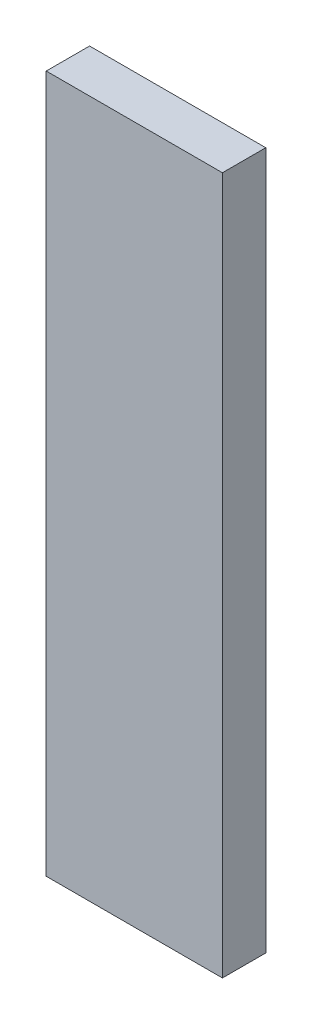
ISO-10303-21;
HEADER;
FILE_DESCRIPTION(('STEP AP214'),'2;1');
FILE_NAME('part.step','',(''),(''),'','','');
FILE_SCHEMA(('AUTOMOTIVE_DESIGN { 1 0 10303 214 1 1 1 1 }'));
ENDSEC;
DATA;
#1=APPLICATION_CONTEXT('core data for automotive mechanical design processes');
#2=APPLICATION_PROTOCOL_DEFINITION('international standard','automotive_design',2000,#1);
#3=PRODUCT_CONTEXT('',#1,'mechanical');
#4=PRODUCT('Part','Part','',(#3));
#5=PRODUCT_RELATED_PRODUCT_CATEGORY('part','',(#4));
#6=PRODUCT_DEFINITION_FORMATION('','',#4);
#7=PRODUCT_DEFINITION_CONTEXT('part definition',#1,'design');
#8=PRODUCT_DEFINITION('design','',#6,#7);
#9=PRODUCT_DEFINITION_SHAPE('','',#8);
#10=(LENGTH_UNIT() NAMED_UNIT(*) SI_UNIT(.MILLI.,.METRE.));
#11=(NAMED_UNIT(*) PLANE_ANGLE_UNIT() SI_UNIT($,.RADIAN.));
#12=(NAMED_UNIT(*) SI_UNIT($,.STERADIAN.) SOLID_ANGLE_UNIT());
#13=UNCERTAINTY_MEASURE_WITH_UNIT(LENGTH_MEASURE(1.E-05),#10,'distance_accuracy_value','');
#14=(GEOMETRIC_REPRESENTATION_CONTEXT(3) GLOBAL_UNCERTAINTY_ASSIGNED_CONTEXT((#13)) GLOBAL_UNIT_ASSIGNED_CONTEXT((#10,
#11,#12)) REPRESENTATION_CONTEXT('',''));
#15=CARTESIAN_POINT('',(0.,0.,0.));
#16=DIRECTION('',(0.,0.,1.));
#17=DIRECTION('',(1.,0.,0.));
#18=AXIS2_PLACEMENT_3D('',#15,#16,#17);
#19=CARTESIAN_POINT('',(-37.5648019739697,-2.3820263364277,1.27));
#20=DIRECTION('',(0.,1.,0.));
#21=DIRECTION('',(0.,0.,1.));
#22=AXIS2_PLACEMENT_3D('',#19,#20,#21);
#23=PLANE('',#22);
#24=DIRECTION('',(1.,0.,0.));
#25=VECTOR('',#24,1.);
#26=CARTESIAN_POINT('',(-37.5648019739697,-2.3820263364277,0.));
#27=LINE('',#26,#25);
#28=CARTESIAN_POINT('',(-37.5648019739697,-2.3820263364277,0.));
#29=VERTEX_POINT('',#28);
#30=CARTESIAN_POINT('',(-32.4024186657096,-2.3820263364277,0.));
#31=VERTEX_POINT('',#30);
#32=EDGE_CURVE('E140',#29,#31,#27,.T.);
#33=ORIENTED_EDGE('',*,*,#32,.T.);
#34=DIRECTION('',(0.,0.,-1.));
#35=VECTOR('',#34,1.);
#36=CARTESIAN_POINT('',(-32.4024186657096,-2.3820263364277,1.27));
#37=LINE('',#36,#35);
#38=CARTESIAN_POINT('',(-32.4024186657096,-2.3820263364277,1.27));
#39=VERTEX_POINT('',#38);
#40=EDGE_CURVE('E11',#39,#31,#37,.T.);
#41=ORIENTED_EDGE('',*,*,#40,.F.);
#42=DIRECTION('',(1.,0.,0.));
#43=VECTOR('',#42,1.);
#44=CARTESIAN_POINT('',(-37.5648019739697,-2.3820263364277,1.27));
#45=LINE('',#44,#43);
#46=CARTESIAN_POINT('',(-37.5648019739697,-2.3820263364277,1.27));
#47=VERTEX_POINT('',#46);
#48=EDGE_CURVE('E81',#47,#39,#45,.T.);
#49=ORIENTED_EDGE('',*,*,#48,.F.);
#50=DIRECTION('',(0.,0.,-1.));
#51=VECTOR('',#50,1.);
#52=CARTESIAN_POINT('',(-37.5648019739697,-2.3820263364277,1.27));
#53=LINE('',#52,#51);
#54=EDGE_CURVE('E152',#47,#29,#53,.T.);
#55=ORIENTED_EDGE('',*,*,#54,.T.);
#56=EDGE_LOOP('',(#33,#41,#49,#55));
#57=FACE_BOUND('',#56,.T.);
#58=ADVANCED_FACE('F33',(#57),#23,.F.);
#59=CARTESIAN_POINT('',(-32.4024186657096,18.0530258479316,1.27));
#60=DIRECTION('',(1.,0.,0.));
#61=DIRECTION('',(0.,0.,-1.));
#62=AXIS2_PLACEMENT_3D('',#59,#60,#61);
#63=PLANE('',#62);
#64=DIRECTION('',(0.,-1.,0.));
#65=VECTOR('',#64,1.);
#66=CARTESIAN_POINT('',(-32.4024186657096,18.0530258479316,0.));
#67=LINE('',#66,#65);
#68=CARTESIAN_POINT('',(-32.4024186657096,18.0530258479316,0.));
#69=VERTEX_POINT('',#68);
#70=EDGE_CURVE('E155',#69,#31,#67,.T.);
#71=ORIENTED_EDGE('',*,*,#70,.F.);
#72=DIRECTION('',(0.,0.,-1.));
#73=VECTOR('',#72,1.);
#74=CARTESIAN_POINT('',(-32.4024186657096,18.0530258479316,1.27));
#75=LINE('',#74,#73);
#76=CARTESIAN_POINT('',(-32.4024186657096,18.0530258479316,1.27));
#77=VERTEX_POINT('',#76);
#78=EDGE_CURVE('E40',#77,#69,#75,.T.);
#79=ORIENTED_EDGE('',*,*,#78,.F.);
#80=DIRECTION('',(0.,-1.,0.));
#81=VECTOR('',#80,1.);
#82=CARTESIAN_POINT('',(-32.4024186657096,18.0530258479316,1.27));
#83=LINE('',#82,#81);
#84=EDGE_CURVE('E145',#77,#39,#83,.T.);
#85=ORIENTED_EDGE('',*,*,#84,.T.);
#86=ORIENTED_EDGE('',*,*,#40,.T.);
#87=EDGE_LOOP('',(#71,#79,#85,#86));
#88=FACE_BOUND('',#87,.T.);
#89=ADVANCED_FACE('F169',(#88),#63,.T.);
#90=CARTESIAN_POINT('',(-37.5648019739697,18.0530258479316,1.27));
#91=DIRECTION('',(0.,1.,0.));
#92=DIRECTION('',(0.,0.,1.));
#93=AXIS2_PLACEMENT_3D('',#90,#91,#92);
#94=PLANE('',#93);
#95=DIRECTION('',(1.,0.,0.));
#96=VECTOR('',#95,1.);
#97=CARTESIAN_POINT('',(-37.5648019739697,18.0530258479316,0.));
#98=LINE('',#97,#96);
#99=CARTESIAN_POINT('',(-37.5648019739697,18.0530258479316,0.));
#100=VERTEX_POINT('',#99);
#101=EDGE_CURVE('E158',#100,#69,#98,.T.);
#102=ORIENTED_EDGE('',*,*,#101,.F.);
#103=DIRECTION('',(0.,0.,-1.));
#104=VECTOR('',#103,1.);
#105=CARTESIAN_POINT('',(-37.5648019739697,18.0530258479316,1.27));
#106=LINE('',#105,#104);
#107=CARTESIAN_POINT('',(-37.5648019739697,18.0530258479316,1.27));
#108=VERTEX_POINT('',#107);
#109=EDGE_CURVE('E163',#108,#100,#106,.T.);
#110=ORIENTED_EDGE('',*,*,#109,.F.);
#111=DIRECTION('',(1.,0.,0.));
#112=VECTOR('',#111,1.);
#113=CARTESIAN_POINT('',(-37.5648019739697,18.0530258479316,1.27));
#114=LINE('',#113,#112);
#115=EDGE_CURVE('E148',#108,#77,#114,.T.);
#116=ORIENTED_EDGE('',*,*,#115,.T.);
#117=ORIENTED_EDGE('',*,*,#78,.T.);
#118=EDGE_LOOP('',(#102,#110,#116,#117));
#119=FACE_BOUND('',#118,.T.);
#120=ADVANCED_FACE('F167',(#119),#94,.T.);
#121=CARTESIAN_POINT('',(-37.5648019739697,18.0530258479316,1.27));
#122=DIRECTION('',(1.,0.,0.));
#123=DIRECTION('',(0.,0.,-1.));
#124=AXIS2_PLACEMENT_3D('',#121,#122,#123);
#125=PLANE('',#124);
#126=DIRECTION('',(0.,0.,-1.));
#127=VECTOR('',#126,1.);
#128=CARTESIAN_POINT('',(-37.5648019739697,16.8739681908789,0.191724219646972));
#129=LINE('',#128,#127);
#130=CARTESIAN_POINT('',(-37.5648019739697,16.8739681908789,1.03065807070379));
#131=VERTEX_POINT('',#130);
#132=CARTESIAN_POINT('',(-37.5648019739697,16.8739681908789,0.191724219646972));
#133=VERTEX_POINT('',#132);
#134=EDGE_CURVE('E134',#131,#133,#129,.T.);
#135=ORIENTED_EDGE('',*,*,#134,.F.);
#136=DIRECTION('',(0.,1.,0.));
#137=VECTOR('',#136,1.);
#138=CARTESIAN_POINT('',(-37.5648019739697,16.8739681908789,1.03065807070379));
#139=LINE('',#138,#137);
#140=CARTESIAN_POINT('',(-37.5648019739697,12.9918277277312,1.03065807070379));
#141=VERTEX_POINT('',#140);
#142=EDGE_CURVE('E47',#141,#131,#139,.T.);
#143=ORIENTED_EDGE('',*,*,#142,.F.);
#144=DIRECTION('',(0.,0.,1.));
#145=VECTOR('',#144,1.);
#146=CARTESIAN_POINT('',(-37.5648019739697,12.9918277277312,0.191724219646972));
#147=LINE('',#146,#145);
#148=CARTESIAN_POINT('',(-37.5648019739697,12.9918277277312,0.191724219646972));
#149=VERTEX_POINT('',#148);
#150=EDGE_CURVE('E125',#149,#141,#147,.T.);
#151=ORIENTED_EDGE('',*,*,#150,.F.);
#152=DIRECTION('',(0.,-1.,0.));
#153=VECTOR('',#152,1.);
#154=CARTESIAN_POINT('',(-37.5648019739697,16.8739681908789,0.191724219646972));
#155=LINE('',#154,#153);
#156=EDGE_CURVE('E128',#133,#149,#155,.T.);
#157=ORIENTED_EDGE('',*,*,#156,.F.);
#158=EDGE_LOOP('',(#135,#143,#151,#157));
#159=FACE_BOUND('',#158,.T.);
#160=DIRECTION('',(0.,-1.,0.));
#161=VECTOR('',#160,1.);
#162=CARTESIAN_POINT('',(-37.5648019739697,18.0530258479316,0.));
#163=LINE('',#162,#161);
#164=EDGE_CURVE('E76',#100,#29,#163,.T.);
#165=ORIENTED_EDGE('',*,*,#164,.T.);
#166=ORIENTED_EDGE('',*,*,#54,.F.);
#167=DIRECTION('',(0.,-1.,0.));
#168=VECTOR('',#167,1.);
#169=CARTESIAN_POINT('',(-37.5648019739697,18.0530258479316,1.27));
#170=LINE('',#169,#168);
#171=EDGE_CURVE('E56',#108,#47,#170,.T.);
#172=ORIENTED_EDGE('',*,*,#171,.F.);
#173=ORIENTED_EDGE('',*,*,#109,.T.);
#174=EDGE_LOOP('',(#165,#166,#172,#173));
#175=FACE_BOUND('',#174,.T.);
#176=ADVANCED_FACE('F174',(#159,#175),#125,.F.);
#177=CARTESIAN_POINT('',(0.,0.,1.27));
#178=DIRECTION('',(0.,0.,-1.));
#179=DIRECTION('',(-1.,0.,0.));
#180=AXIS2_PLACEMENT_3D('',#177,#178,#179);
#181=PLANE('',#180);
#182=ORIENTED_EDGE('',*,*,#48,.T.);
#183=ORIENTED_EDGE('',*,*,#84,.F.);
#184=ORIENTED_EDGE('',*,*,#115,.F.);
#185=ORIENTED_EDGE('',*,*,#171,.T.);
#186=EDGE_LOOP('',(#182,#183,#184,#185));
#187=FACE_BOUND('',#186,.T.);
#188=ADVANCED_FACE('F175',(#187),#181,.F.);
#189=CARTESIAN_POINT('',(0.,0.,0.));
#190=DIRECTION('',(0.,0.,-1.));
#191=DIRECTION('',(-1.,0.,0.));
#192=AXIS2_PLACEMENT_3D('',#189,#190,#191);
#193=PLANE('',#192);
#194=ORIENTED_EDGE('',*,*,#32,.F.);
#195=ORIENTED_EDGE('',*,*,#164,.F.);
#196=ORIENTED_EDGE('',*,*,#101,.T.);
#197=ORIENTED_EDGE('',*,*,#70,.T.);
#198=EDGE_LOOP('',(#194,#195,#196,#197));
#199=FACE_BOUND('',#198,.T.);
#200=ADVANCED_FACE('F172',(#199),#193,.T.);
#201=CARTESIAN_POINT('',(-33.7548019739697,16.8739681908789,1.03065807070379));
#202=DIRECTION('',(0.,0.,1.));
#203=DIRECTION('',(1.,0.,0.));
#204=AXIS2_PLACEMENT_3D('',#201,#202,#203);
#205=PLANE('',#204);
#206=ORIENTED_EDGE('',*,*,#142,.T.);
#207=DIRECTION('',(-1.,0.,0.));
#208=VECTOR('',#207,1.);
#209=CARTESIAN_POINT('',(-33.7548019739697,16.8739681908789,1.03065807070379));
#210=LINE('',#209,#208);
#211=CARTESIAN_POINT('',(-33.7548019739697,16.8739681908789,1.03065807070379));
#212=VERTEX_POINT('',#211);
#213=EDGE_CURVE('E103',#212,#131,#210,.T.);
#214=ORIENTED_EDGE('',*,*,#213,.F.);
#215=DIRECTION('',(0.,1.,0.));
#216=VECTOR('',#215,1.);
#217=CARTESIAN_POINT('',(-33.7548019739697,16.8739681908789,1.03065807070379));
#218=LINE('',#217,#216);
#219=CARTESIAN_POINT('',(-33.7548019739697,12.9918277277312,1.03065807070379));
#220=VERTEX_POINT('',#219);
#221=EDGE_CURVE('E107',#220,#212,#218,.T.);
#222=ORIENTED_EDGE('',*,*,#221,.F.);
#223=DIRECTION('',(-1.,0.,0.));
#224=VECTOR('',#223,1.);
#225=CARTESIAN_POINT('',(-33.7548019739697,12.9918277277312,1.03065807070379));
#226=LINE('',#225,#224);
#227=EDGE_CURVE('E138',#220,#141,#226,.T.);
#228=ORIENTED_EDGE('',*,*,#227,.T.);
#229=EDGE_LOOP('',(#206,#214,#222,#228));
#230=FACE_BOUND('',#229,.T.);
#231=ADVANCED_FACE('F105',(#230),#205,.F.);
#232=CARTESIAN_POINT('',(-33.7548019739697,12.9918277277312,0.191724219646972));
#233=DIRECTION('',(0.,-1.,0.));
#234=DIRECTION('',(0.,0.,-1.));
#235=AXIS2_PLACEMENT_3D('',#232,#233,#234);
#236=PLANE('',#235);
#237=ORIENTED_EDGE('',*,*,#150,.T.);
#238=ORIENTED_EDGE('',*,*,#227,.F.);
#239=DIRECTION('',(0.,0.,1.));
#240=VECTOR('',#239,1.);
#241=CARTESIAN_POINT('',(-33.7548019739697,12.9918277277312,0.191724219646972));
#242=LINE('',#241,#240);
#243=CARTESIAN_POINT('',(-33.7548019739697,12.9918277277312,0.191724219646972));
#244=VERTEX_POINT('',#243);
#245=EDGE_CURVE('E113',#244,#220,#242,.T.);
#246=ORIENTED_EDGE('',*,*,#245,.F.);
#247=DIRECTION('',(-1.,0.,0.));
#248=VECTOR('',#247,1.);
#249=CARTESIAN_POINT('',(-33.7548019739697,12.9918277277312,0.191724219646972));
#250=LINE('',#249,#248);
#251=EDGE_CURVE('E141',#244,#149,#250,.T.);
#252=ORIENTED_EDGE('',*,*,#251,.T.);
#253=EDGE_LOOP('',(#237,#238,#246,#252));
#254=FACE_BOUND('',#253,.T.);
#255=ADVANCED_FACE('F213',(#254),#236,.F.);
#256=CARTESIAN_POINT('',(-33.7548019739697,16.8739681908789,0.191724219646972));
#257=DIRECTION('',(0.,0.,-1.));
#258=DIRECTION('',(-1.,0.,0.));
#259=AXIS2_PLACEMENT_3D('',#256,#257,#258);
#260=PLANE('',#259);
#261=ORIENTED_EDGE('',*,*,#156,.T.);
#262=ORIENTED_EDGE('',*,*,#251,.F.);
#263=DIRECTION('',(0.,-1.,0.));
#264=VECTOR('',#263,1.);
#265=CARTESIAN_POINT('',(-33.7548019739697,16.8739681908789,0.191724219646972));
#266=LINE('',#265,#264);
#267=CARTESIAN_POINT('',(-33.7548019739697,16.8739681908789,0.191724219646972));
#268=VERTEX_POINT('',#267);
#269=EDGE_CURVE('E121',#268,#244,#266,.T.);
#270=ORIENTED_EDGE('',*,*,#269,.F.);
#271=DIRECTION('',(-1.,0.,0.));
#272=VECTOR('',#271,1.);
#273=CARTESIAN_POINT('',(-33.7548019739697,16.8739681908789,0.191724219646972));
#274=LINE('',#273,#272);
#275=EDGE_CURVE('E112',#268,#133,#274,.T.);
#276=ORIENTED_EDGE('',*,*,#275,.T.);
#277=EDGE_LOOP('',(#261,#262,#270,#276));
#278=FACE_BOUND('',#277,.T.);
#279=ADVANCED_FACE('F221',(#278),#260,.F.);
#280=CARTESIAN_POINT('',(-33.7548019739697,16.8739681908789,0.191724219646972));
#281=DIRECTION('',(0.,1.,0.));
#282=DIRECTION('',(0.,0.,1.));
#283=AXIS2_PLACEMENT_3D('',#280,#281,#282);
#284=PLANE('',#283);
#285=ORIENTED_EDGE('',*,*,#134,.T.);
#286=ORIENTED_EDGE('',*,*,#275,.F.);
#287=DIRECTION('',(0.,0.,-1.));
#288=VECTOR('',#287,1.);
#289=CARTESIAN_POINT('',(-33.7548019739697,16.8739681908789,0.191724219646972));
#290=LINE('',#289,#288);
#291=EDGE_CURVE('E116',#212,#268,#290,.T.);
#292=ORIENTED_EDGE('',*,*,#291,.F.);
#293=ORIENTED_EDGE('',*,*,#213,.T.);
#294=EDGE_LOOP('',(#285,#286,#292,#293));
#295=FACE_BOUND('',#294,.T.);
#296=ADVANCED_FACE('F117',(#295),#284,.F.);
#297=CARTESIAN_POINT('',(-33.7548019739697,0.,0.));
#298=DIRECTION('',(-1.,0.,0.));
#299=DIRECTION('',(0.,0.,1.));
#300=AXIS2_PLACEMENT_3D('',#297,#298,#299);
#301=PLANE('',#300);
#302=ORIENTED_EDGE('',*,*,#221,.T.);
#303=ORIENTED_EDGE('',*,*,#291,.T.);
#304=ORIENTED_EDGE('',*,*,#269,.T.);
#305=ORIENTED_EDGE('',*,*,#245,.T.);
#306=EDGE_LOOP('',(#302,#303,#304,#305));
#307=FACE_BOUND('',#306,.T.);
#308=ADVANCED_FACE('F123',(#307),#301,.T.);
#309=CLOSED_SHELL('',(#58,#89,#120,#176,#188,#200,#231,#255,#279,#296,#308));
#310=MANIFOLD_SOLID_BREP('B2',#309);
#311=ADVANCED_BREP_SHAPE_REPRESENTATION('',(#18,#310),#14);
#312=SHAPE_DEFINITION_REPRESENTATION(#9,#311);
ENDSEC;
END-ISO-10303-21;
